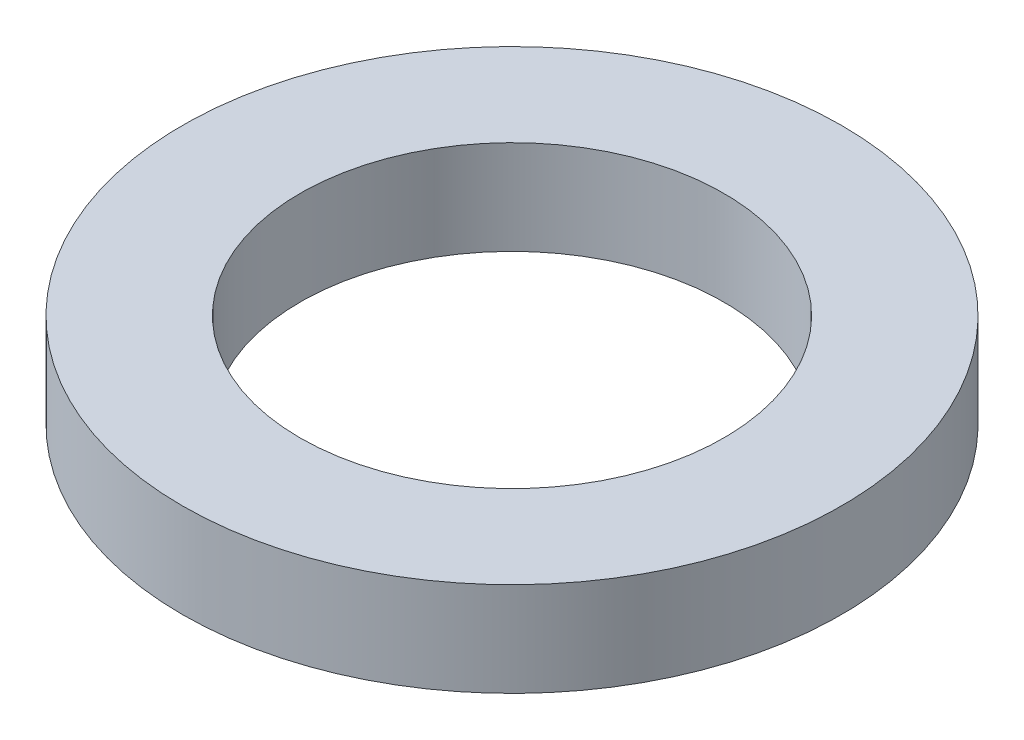
ISO-10303-21;
HEADER;
FILE_DESCRIPTION(('STEP AP214'),'2;1');
FILE_NAME('part.step','',(''),(''),'','','');
FILE_SCHEMA(('AUTOMOTIVE_DESIGN { 1 0 10303 214 1 1 1 1 }'));
ENDSEC;
DATA;
#1=APPLICATION_CONTEXT('core data for automotive mechanical design processes');
#2=APPLICATION_PROTOCOL_DEFINITION('international standard','automotive_design',2000,#1);
#3=PRODUCT_CONTEXT('',#1,'mechanical');
#4=PRODUCT('Part','Part','',(#3));
#5=PRODUCT_RELATED_PRODUCT_CATEGORY('part','',(#4));
#6=PRODUCT_DEFINITION_FORMATION('','',#4);
#7=PRODUCT_DEFINITION_CONTEXT('part definition',#1,'design');
#8=PRODUCT_DEFINITION('design','',#6,#7);
#9=PRODUCT_DEFINITION_SHAPE('','',#8);
#10=(LENGTH_UNIT() NAMED_UNIT(*) SI_UNIT(.MILLI.,.METRE.));
#11=(NAMED_UNIT(*) PLANE_ANGLE_UNIT() SI_UNIT($,.RADIAN.));
#12=(NAMED_UNIT(*) SI_UNIT($,.STERADIAN.) SOLID_ANGLE_UNIT());
#13=UNCERTAINTY_MEASURE_WITH_UNIT(LENGTH_MEASURE(1.E-05),#10,'distance_accuracy_value','');
#14=(GEOMETRIC_REPRESENTATION_CONTEXT(3) GLOBAL_UNCERTAINTY_ASSIGNED_CONTEXT((#13)) GLOBAL_UNIT_ASSIGNED_CONTEXT((#10,
#11,#12)) REPRESENTATION_CONTEXT('',''));
#15=CARTESIAN_POINT('',(0.,0.,0.));
#16=DIRECTION('',(0.,0.,1.));
#17=DIRECTION('',(1.,0.,0.));
#18=AXIS2_PLACEMENT_3D('',#15,#16,#17);
#19=CARTESIAN_POINT('',(0.,10.,0.));
#20=DIRECTION('',(0.,-1.,0.));
#21=DIRECTION('',(0.,0.,-1.));
#22=AXIS2_PLACEMENT_3D('',#19,#20,#21);
#23=CYLINDRICAL_SURFACE('',#22,35.);
#24=CARTESIAN_POINT('',(0.,10.,0.));
#25=DIRECTION('',(0.,1.,0.));
#26=DIRECTION('',(0.,0.,1.));
#27=AXIS2_PLACEMENT_3D('',#24,#25,#26);
#28=CIRCLE('',#27,35.);
#29=CARTESIAN_POINT('',(0.,10.,35.));
#30=VERTEX_POINT('',#29);
#31=EDGE_CURVE('E10',#30,#30,#28,.T.);
#32=ORIENTED_EDGE('',*,*,#31,.F.);
#33=EDGE_LOOP('',(#32));
#34=FACE_BOUND('',#33,.T.);
#35=CARTESIAN_POINT('',(0.,0.,0.));
#36=DIRECTION('',(0.,1.,0.));
#37=DIRECTION('',(0.,0.,1.));
#38=AXIS2_PLACEMENT_3D('',#35,#36,#37);
#39=CIRCLE('',#38,35.);
#40=CARTESIAN_POINT('',(0.,0.,35.));
#41=VERTEX_POINT('',#40);
#42=EDGE_CURVE('E37',#41,#41,#39,.T.);
#43=ORIENTED_EDGE('',*,*,#42,.T.);
#44=EDGE_LOOP('',(#43));
#45=FACE_BOUND('',#44,.T.);
#46=ADVANCED_FACE('F40',(#34,#45),#23,.T.);
#47=CARTESIAN_POINT('',(0.,10.,0.));
#48=DIRECTION('',(0.,1.,0.));
#49=DIRECTION('',(0.,0.,1.));
#50=AXIS2_PLACEMENT_3D('',#47,#48,#49);
#51=PLANE('',#50);
#52=CARTESIAN_POINT('',(0.,10.,0.));
#53=DIRECTION('',(0.,1.,0.));
#54=DIRECTION('',(0.,0.,1.));
#55=AXIS2_PLACEMENT_3D('',#52,#53,#54);
#56=CIRCLE('',#55,22.5);
#57=CARTESIAN_POINT('',(0.,10.,22.5));
#58=VERTEX_POINT('',#57);
#59=EDGE_CURVE('E50',#58,#58,#56,.T.);
#60=ORIENTED_EDGE('',*,*,#59,.F.);
#61=EDGE_LOOP('',(#60));
#62=FACE_BOUND('',#61,.T.);
#63=ORIENTED_EDGE('',*,*,#31,.T.);
#64=EDGE_LOOP('',(#63));
#65=FACE_BOUND('',#64,.T.);
#66=ADVANCED_FACE('F59',(#62,#65),#51,.T.);
#67=CARTESIAN_POINT('',(0.,0.,0.));
#68=DIRECTION('',(0.,1.,0.));
#69=DIRECTION('',(0.,0.,1.));
#70=AXIS2_PLACEMENT_3D('',#67,#68,#69);
#71=PLANE('',#70);
#72=CARTESIAN_POINT('',(0.,0.,0.));
#73=DIRECTION('',(0.,1.,0.));
#74=DIRECTION('',(0.,0.,1.));
#75=AXIS2_PLACEMENT_3D('',#72,#73,#74);
#76=CIRCLE('',#75,22.5);
#77=CARTESIAN_POINT('',(0.,0.,22.5));
#78=VERTEX_POINT('',#77);
#79=EDGE_CURVE('E47',#78,#78,#76,.T.);
#80=ORIENTED_EDGE('',*,*,#79,.T.);
#81=EDGE_LOOP('',(#80));
#82=FACE_BOUND('',#81,.T.);
#83=ORIENTED_EDGE('',*,*,#42,.F.);
#84=EDGE_LOOP('',(#83));
#85=FACE_BOUND('',#84,.T.);
#86=ADVANCED_FACE('F58',(#82,#85),#71,.F.);
#87=CARTESIAN_POINT('',(0.,10.,0.));
#88=DIRECTION('',(0.,-1.,0.));
#89=DIRECTION('',(0.,0.,-1.));
#90=AXIS2_PLACEMENT_3D('',#87,#88,#89);
#91=CYLINDRICAL_SURFACE('',#90,22.5);
#92=ORIENTED_EDGE('',*,*,#59,.T.);
#93=EDGE_LOOP('',(#92));
#94=FACE_BOUND('',#93,.T.);
#95=ORIENTED_EDGE('',*,*,#79,.F.);
#96=EDGE_LOOP('',(#95));
#97=FACE_BOUND('',#96,.T.);
#98=ADVANCED_FACE('F54',(#94,#97),#91,.F.);
#99=CLOSED_SHELL('',(#46,#66,#86,#98));
#100=MANIFOLD_SOLID_BREP('B2',#99);
#101=ADVANCED_BREP_SHAPE_REPRESENTATION('',(#18,#100),#14);
#102=SHAPE_DEFINITION_REPRESENTATION(#9,#101);
ENDSEC;
END-ISO-10303-21;
